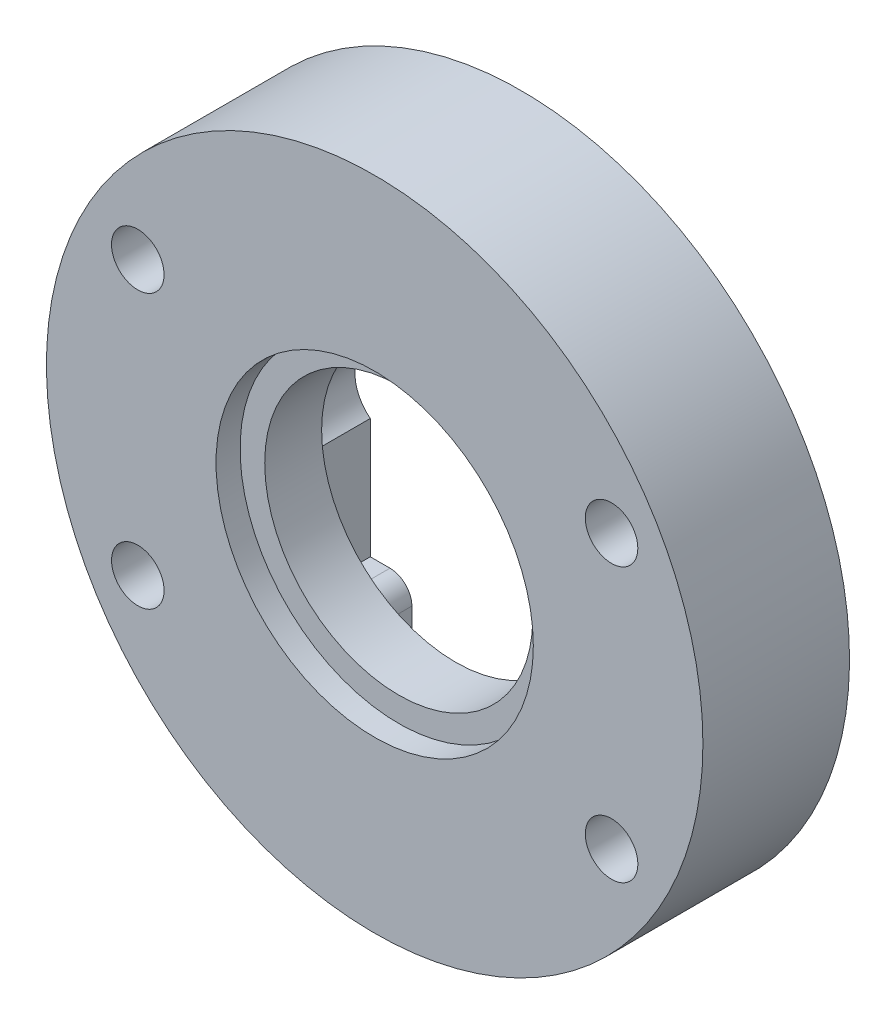
ISO-10303-21;
HEADER;
FILE_DESCRIPTION(('STEP AP214'),'2;1');
FILE_NAME('part.step','',(''),(''),'','','');
FILE_SCHEMA(('AUTOMOTIVE_DESIGN { 1 0 10303 214 1 1 1 1 }'));
ENDSEC;
DATA;
#1=APPLICATION_CONTEXT('core data for automotive mechanical design processes');
#2=APPLICATION_PROTOCOL_DEFINITION('international standard','automotive_design',2000,#1);
#3=PRODUCT_CONTEXT('',#1,'mechanical');
#4=PRODUCT('Part','Part','',(#3));
#5=PRODUCT_RELATED_PRODUCT_CATEGORY('part','',(#4));
#6=PRODUCT_DEFINITION_FORMATION('','',#4);
#7=PRODUCT_DEFINITION_CONTEXT('part definition',#1,'design');
#8=PRODUCT_DEFINITION('design','',#6,#7);
#9=PRODUCT_DEFINITION_SHAPE('','',#8);
#10=(LENGTH_UNIT() NAMED_UNIT(*) SI_UNIT(.MILLI.,.METRE.));
#11=(NAMED_UNIT(*) PLANE_ANGLE_UNIT() SI_UNIT($,.RADIAN.));
#12=(NAMED_UNIT(*) SI_UNIT($,.STERADIAN.) SOLID_ANGLE_UNIT());
#13=UNCERTAINTY_MEASURE_WITH_UNIT(LENGTH_MEASURE(1.E-05),#10,'distance_accuracy_value','');
#14=(GEOMETRIC_REPRESENTATION_CONTEXT(3) GLOBAL_UNCERTAINTY_ASSIGNED_CONTEXT((#13)) GLOBAL_UNIT_ASSIGNED_CONTEXT((#10,
#11,#12)) REPRESENTATION_CONTEXT('',''));
#15=CARTESIAN_POINT('',(0.,0.,0.));
#16=DIRECTION('',(0.,0.,1.));
#17=DIRECTION('',(1.,0.,0.));
#18=AXIS2_PLACEMENT_3D('',#15,#16,#17);
#19=CARTESIAN_POINT('',(0.,0.,5.6));
#20=DIRECTION('',(0.,0.,1.));
#21=DIRECTION('',(1.,0.,0.));
#22=AXIS2_PLACEMENT_3D('',#19,#20,#21);
#23=PLANE('',#22);
#24=CARTESIAN_POINT('',(0.,0.,5.6));
#25=DIRECTION('',(0.,0.,1.));
#26=DIRECTION('',(1.,0.,0.));
#27=AXIS2_PLACEMENT_3D('',#24,#25,#26);
#28=CIRCLE('',#27,6.125);
#29=CARTESIAN_POINT('',(6.125,0.,5.6));
#30=VERTEX_POINT('',#29);
#31=EDGE_CURVE('E337',#30,#30,#28,.T.);
#32=ORIENTED_EDGE('',*,*,#31,.F.);
#33=EDGE_LOOP('',(#32));
#34=FACE_BOUND('',#33,.T.);
#35=CARTESIAN_POINT('',(0.,0.,5.6));
#36=DIRECTION('',(0.,0.,1.));
#37=DIRECTION('',(1.,0.,0.));
#38=AXIS2_PLACEMENT_3D('',#35,#36,#37);
#39=CIRCLE('',#38,7.25);
#40=CARTESIAN_POINT('',(7.25,0.,5.6));
#41=VERTEX_POINT('',#40);
#42=EDGE_CURVE('E220',#41,#41,#39,.F.);
#43=ORIENTED_EDGE('',*,*,#42,.F.);
#44=EDGE_LOOP('',(#43));
#45=FACE_BOUND('',#44,.T.);
#46=ADVANCED_FACE('F35',(#34,#45),#23,.T.);
#47=CARTESIAN_POINT('',(6.90000000000001,-6.9,3.));
#48=DIRECTION('',(1.,0.,0.));
#49=DIRECTION('',(0.,1.,0.));
#50=AXIS2_PLACEMENT_3D('',#47,#48,#49);
#51=PLANE('',#50);
#52=DIRECTION('',(0.,-1.,0.));
#53=VECTOR('',#52,1.);
#54=CARTESIAN_POINT('',(6.90000000000001,-6.9,0.));
#55=LINE('',#54,#53);
#56=CARTESIAN_POINT('',(6.9,6.9,0.));
#57=VERTEX_POINT('',#56);
#58=CARTESIAN_POINT('',(6.9,1.4247806848775,0.));
#59=VERTEX_POINT('',#58);
#60=EDGE_CURVE('E143',#57,#59,#55,.T.);
#61=ORIENTED_EDGE('',*,*,#60,.T.);
#62=DIRECTION('',(0.,0.,1.));
#63=VECTOR('',#62,1.);
#64=CARTESIAN_POINT('',(6.9,1.4247806848775,0.));
#65=LINE('',#64,#63);
#66=CARTESIAN_POINT('',(6.9,1.4247806848775,3.));
#67=VERTEX_POINT('',#66);
#68=EDGE_CURVE('E135',#59,#67,#65,.T.);
#69=ORIENTED_EDGE('',*,*,#68,.T.);
#70=DIRECTION('',(0.,-1.,0.));
#71=VECTOR('',#70,1.);
#72=CARTESIAN_POINT('',(6.90000000000001,-6.9,3.));
#73=LINE('',#72,#71);
#74=CARTESIAN_POINT('',(6.9,6.9,3.));
#75=VERTEX_POINT('',#74);
#76=EDGE_CURVE('E140',#75,#67,#73,.T.);
#77=ORIENTED_EDGE('',*,*,#76,.F.);
#78=DIRECTION('',(0.,0.,-1.));
#79=VECTOR('',#78,1.);
#80=CARTESIAN_POINT('',(6.9,6.9,3.));
#81=LINE('',#80,#79);
#82=EDGE_CURVE('E181',#75,#57,#81,.T.);
#83=ORIENTED_EDGE('',*,*,#82,.T.);
#84=EDGE_LOOP('',(#61,#69,#77,#83));
#85=FACE_BOUND('',#84,.T.);
#86=ADVANCED_FACE('F137',(#85),#51,.F.);
#87=CARTESIAN_POINT('',(-6.9,-6.9,3.));
#88=DIRECTION('',(-1.,0.,0.));
#89=DIRECTION('',(0.,0.,1.));
#90=AXIS2_PLACEMENT_3D('',#87,#88,#89);
#91=PLANE('',#90);
#92=DIRECTION('',(0.,1.,0.));
#93=VECTOR('',#92,1.);
#94=CARTESIAN_POINT('',(-6.9,-6.9,0.));
#95=LINE('',#94,#93);
#96=CARTESIAN_POINT('',(-6.9,-6.9,0.));
#97=VERTEX_POINT('',#96);
#98=CARTESIAN_POINT('',(-6.9,-1.4247806848775,0.));
#99=VERTEX_POINT('',#98);
#100=EDGE_CURVE('E195',#97,#99,#95,.T.);
#101=ORIENTED_EDGE('',*,*,#100,.T.);
#102=DIRECTION('',(0.,0.,1.));
#103=VECTOR('',#102,1.);
#104=CARTESIAN_POINT('',(-6.9,-1.4247806848775,0.));
#105=LINE('',#104,#103);
#106=CARTESIAN_POINT('',(-6.9,-1.4247806848775,3.));
#107=VERTEX_POINT('',#106);
#108=EDGE_CURVE('E330',#99,#107,#105,.T.);
#109=ORIENTED_EDGE('',*,*,#108,.T.);
#110=DIRECTION('',(0.,1.,0.));
#111=VECTOR('',#110,1.);
#112=CARTESIAN_POINT('',(-6.9,-6.9,3.));
#113=LINE('',#112,#111);
#114=CARTESIAN_POINT('',(-6.9,-6.9,3.));
#115=VERTEX_POINT('',#114);
#116=EDGE_CURVE('E177',#115,#107,#113,.T.);
#117=ORIENTED_EDGE('',*,*,#116,.F.);
#118=DIRECTION('',(0.,0.,-1.));
#119=VECTOR('',#118,1.);
#120=CARTESIAN_POINT('',(-6.9,-6.9,3.));
#121=LINE('',#120,#119);
#122=EDGE_CURVE('E203',#115,#97,#121,.T.);
#123=ORIENTED_EDGE('',*,*,#122,.T.);
#124=EDGE_LOOP('',(#101,#109,#117,#123));
#125=FACE_BOUND('',#124,.T.);
#126=ADVANCED_FACE('F277',(#125),#91,.F.);
#127=CARTESIAN_POINT('',(6.90000000000001,-1.42478068487749,3.));
#128=VERTEX_POINT('',#127);
#129=CARTESIAN_POINT('',(6.90000000000001,-6.9,3.));
#130=VERTEX_POINT('',#129);
#131=EDGE_CURVE('E163',#128,#130,#73,.T.);
#132=ORIENTED_EDGE('',*,*,#131,.F.);
#133=DIRECTION('',(0.,0.,1.));
#134=VECTOR('',#133,1.);
#135=CARTESIAN_POINT('',(6.90000000000001,-1.42478068487749,0.));
#136=LINE('',#135,#134);
#137=CARTESIAN_POINT('',(6.90000000000001,-1.42478068487749,0.));
#138=VERTEX_POINT('',#137);
#139=EDGE_CURVE('E147',#128,#138,#136,.F.);
#140=ORIENTED_EDGE('',*,*,#139,.T.);
#141=CARTESIAN_POINT('',(6.90000000000001,-6.9,0.));
#142=VERTEX_POINT('',#141);
#143=EDGE_CURVE('E146',#138,#142,#55,.T.);
#144=ORIENTED_EDGE('',*,*,#143,.T.);
#145=DIRECTION('',(0.,0.,-1.));
#146=VECTOR('',#145,1.);
#147=CARTESIAN_POINT('',(6.90000000000001,-6.9,3.));
#148=LINE('',#147,#146);
#149=EDGE_CURVE('E212',#130,#142,#148,.T.);
#150=ORIENTED_EDGE('',*,*,#149,.F.);
#151=EDGE_LOOP('',(#132,#140,#144,#150));
#152=FACE_BOUND('',#151,.T.);
#153=ADVANCED_FACE('F279',(#152),#51,.F.);
#154=CARTESIAN_POINT('',(6.90000000000001,-6.9,3.));
#155=DIRECTION('',(0.,-1.,0.));
#156=DIRECTION('',(1.,0.,0.));
#157=AXIS2_PLACEMENT_3D('',#154,#155,#156);
#158=PLANE('',#157);
#159=DIRECTION('',(-1.,0.,0.));
#160=VECTOR('',#159,1.);
#161=CARTESIAN_POINT('',(6.90000000000001,-6.9,0.));
#162=LINE('',#161,#160);
#163=CARTESIAN_POINT('',(6.,-6.9,0.));
#164=VERTEX_POINT('',#163);
#165=EDGE_CURVE('E183',#142,#164,#162,.T.);
#166=ORIENTED_EDGE('',*,*,#165,.T.);
#167=DIRECTION('',(0.,0.,-1.));
#168=VECTOR('',#167,1.);
#169=CARTESIAN_POINT('',(6.,-6.9,3.));
#170=LINE('',#169,#168);
#171=CARTESIAN_POINT('',(6.,-6.9,3.));
#172=VERTEX_POINT('',#171);
#173=EDGE_CURVE('E50',#164,#172,#170,.F.);
#174=ORIENTED_EDGE('',*,*,#173,.T.);
#175=DIRECTION('',(-1.,0.,0.));
#176=VECTOR('',#175,1.);
#177=CARTESIAN_POINT('',(6.90000000000001,-6.9,3.));
#178=LINE('',#177,#176);
#179=EDGE_CURVE('E162',#130,#172,#178,.T.);
#180=ORIENTED_EDGE('',*,*,#179,.F.);
#181=ORIENTED_EDGE('',*,*,#149,.T.);
#182=EDGE_LOOP('',(#166,#174,#180,#181));
#183=FACE_BOUND('',#182,.T.);
#184=ADVANCED_FACE('F314',(#183),#158,.F.);
#185=CARTESIAN_POINT('',(5.,-6.9,3.));
#186=DIRECTION('',(1.,0.,0.));
#187=DIRECTION('',(0.,0.,-1.));
#188=AXIS2_PLACEMENT_3D('',#185,#186,#187);
#189=PLANE('',#188);
#190=DIRECTION('',(0.,-1.,0.));
#191=VECTOR('',#190,1.);
#192=CARTESIAN_POINT('',(5.,-6.9,3.));
#193=LINE('',#192,#191);
#194=CARTESIAN_POINT('',(5.,-7.9,3.));
#195=VERTEX_POINT('',#194);
#196=CARTESIAN_POINT('',(5.,-14.1421356237309,3.));
#197=VERTEX_POINT('',#196);
#198=EDGE_CURVE('E165',#195,#197,#193,.T.);
#199=ORIENTED_EDGE('',*,*,#198,.F.);
#200=DIRECTION('',(0.,0.,-1.));
#201=VECTOR('',#200,1.);
#202=CARTESIAN_POINT('',(5.,-7.9,3.));
#203=LINE('',#202,#201);
#204=CARTESIAN_POINT('',(5.,-7.9,0.));
#205=VERTEX_POINT('',#204);
#206=EDGE_CURVE('E232',#195,#205,#203,.T.);
#207=ORIENTED_EDGE('',*,*,#206,.T.);
#208=DIRECTION('',(0.,-1.,0.));
#209=VECTOR('',#208,1.);
#210=CARTESIAN_POINT('',(5.,-6.9,0.));
#211=LINE('',#210,#209);
#212=CARTESIAN_POINT('',(5.,-14.1421356237309,0.));
#213=VERTEX_POINT('',#212);
#214=EDGE_CURVE('E185',#205,#213,#211,.T.);
#215=ORIENTED_EDGE('',*,*,#214,.T.);
#216=DIRECTION('',(0.,0.,-1.));
#217=VECTOR('',#216,1.);
#218=CARTESIAN_POINT('',(5.,-14.1421356237309,3.));
#219=LINE('',#218,#217);
#220=EDGE_CURVE('E209',#197,#213,#219,.T.);
#221=ORIENTED_EDGE('',*,*,#220,.F.);
#222=EDGE_LOOP('',(#199,#207,#215,#221));
#223=FACE_BOUND('',#222,.T.);
#224=ADVANCED_FACE('F263',(#223),#189,.F.);
#225=CARTESIAN_POINT('',(0.,0.,3.));
#226=DIRECTION('',(0.,0.,-1.));
#227=DIRECTION('',(-1.,0.,0.));
#228=AXIS2_PLACEMENT_3D('',#225,#226,#227);
#229=CYLINDRICAL_SURFACE('',#228,15.);
#230=CARTESIAN_POINT('',(0.,0.,0.));
#231=DIRECTION('',(0.,0.,1.));
#232=DIRECTION('',(1.,0.,0.));
#233=AXIS2_PLACEMENT_3D('',#230,#231,#232);
#234=CIRCLE('',#233,15.);
#235=CARTESIAN_POINT('',(-5.00000000000001,-14.1421356237309,0.));
#236=VERTEX_POINT('',#235);
#237=EDGE_CURVE('E187',#213,#236,#234,.T.);
#238=ORIENTED_EDGE('',*,*,#237,.T.);
#239=DIRECTION('',(0.,0.,-1.));
#240=VECTOR('',#239,1.);
#241=CARTESIAN_POINT('',(-5.00000000000001,-14.1421356237309,3.));
#242=LINE('',#241,#240);
#243=CARTESIAN_POINT('',(-5.00000000000001,-14.1421356237309,3.));
#244=VERTEX_POINT('',#243);
#245=EDGE_CURVE('E206',#244,#236,#242,.T.);
#246=ORIENTED_EDGE('',*,*,#245,.F.);
#247=CARTESIAN_POINT('',(0.,0.,3.));
#248=DIRECTION('',(0.,0.,1.));
#249=DIRECTION('',(1.,0.,0.));
#250=AXIS2_PLACEMENT_3D('',#247,#248,#249);
#251=CIRCLE('',#250,15.);
#252=EDGE_CURVE('E156',#244,#197,#251,.T.);
#253=ORIENTED_EDGE('',*,*,#252,.T.);
#254=ORIENTED_EDGE('',*,*,#220,.T.);
#255=EDGE_LOOP('',(#238,#246,#253,#254));
#256=FACE_BOUND('',#255,.T.);
#257=CARTESIAN_POINT('',(0.,0.,6.7));
#258=DIRECTION('',(0.,0.,1.));
#259=DIRECTION('',(1.,0.,0.));
#260=AXIS2_PLACEMENT_3D('',#257,#258,#259);
#261=CIRCLE('',#260,15.);
#262=CARTESIAN_POINT('',(15.,0.,6.7));
#263=VERTEX_POINT('',#262);
#264=EDGE_CURVE('E341',#263,#263,#261,.T.);
#265=ORIENTED_EDGE('',*,*,#264,.F.);
#266=EDGE_LOOP('',(#265));
#267=FACE_BOUND('',#266,.T.);
#268=ADVANCED_FACE('F257',(#256,#267),#229,.T.);
#269=CARTESIAN_POINT('',(-5.,-6.9,3.));
#270=DIRECTION('',(-1.,0.,0.));
#271=DIRECTION('',(0.,-1.,0.));
#272=AXIS2_PLACEMENT_3D('',#269,#270,#271);
#273=PLANE('',#272);
#274=DIRECTION('',(0.,1.,0.));
#275=VECTOR('',#274,1.);
#276=CARTESIAN_POINT('',(-5.,-6.9,0.));
#277=LINE('',#276,#275);
#278=CARTESIAN_POINT('',(-5.,-7.9,0.));
#279=VERTEX_POINT('',#278);
#280=EDGE_CURVE('E189',#236,#279,#277,.T.);
#281=ORIENTED_EDGE('',*,*,#280,.T.);
#282=DIRECTION('',(0.,0.,-1.));
#283=VECTOR('',#282,1.);
#284=CARTESIAN_POINT('',(-5.,-7.9,3.));
#285=LINE('',#284,#283);
#286=CARTESIAN_POINT('',(-5.,-7.9,3.));
#287=VERTEX_POINT('',#286);
#288=EDGE_CURVE('E230',#279,#287,#285,.F.);
#289=ORIENTED_EDGE('',*,*,#288,.T.);
#290=DIRECTION('',(0.,1.,0.));
#291=VECTOR('',#290,1.);
#292=CARTESIAN_POINT('',(-5.,-6.9,3.));
#293=LINE('',#292,#291);
#294=EDGE_CURVE('E171',#244,#287,#293,.T.);
#295=ORIENTED_EDGE('',*,*,#294,.F.);
#296=ORIENTED_EDGE('',*,*,#245,.T.);
#297=EDGE_LOOP('',(#281,#289,#295,#296));
#298=FACE_BOUND('',#297,.T.);
#299=ADVANCED_FACE('F254',(#298),#273,.F.);
#300=CARTESIAN_POINT('',(-5.,-6.9,3.));
#301=DIRECTION('',(0.,-1.,0.));
#302=DIRECTION('',(0.,0.,-1.));
#303=AXIS2_PLACEMENT_3D('',#300,#301,#302);
#304=PLANE('',#303);
#305=DIRECTION('',(-1.,0.,0.));
#306=VECTOR('',#305,1.);
#307=CARTESIAN_POINT('',(-5.,-6.9,3.));
#308=LINE('',#307,#306);
#309=CARTESIAN_POINT('',(-6.,-6.9,3.));
#310=VERTEX_POINT('',#309);
#311=EDGE_CURVE('E174',#310,#115,#308,.T.);
#312=ORIENTED_EDGE('',*,*,#311,.F.);
#313=DIRECTION('',(0.,0.,-1.));
#314=VECTOR('',#313,1.);
#315=CARTESIAN_POINT('',(-6.,-6.9,3.));
#316=LINE('',#315,#314);
#317=CARTESIAN_POINT('',(-6.,-6.9,0.));
#318=VERTEX_POINT('',#317);
#319=EDGE_CURVE('E223',#310,#318,#316,.T.);
#320=ORIENTED_EDGE('',*,*,#319,.T.);
#321=DIRECTION('',(-1.,0.,0.));
#322=VECTOR('',#321,1.);
#323=CARTESIAN_POINT('',(-5.,-6.9,0.));
#324=LINE('',#323,#322);
#325=EDGE_CURVE('E192',#318,#97,#324,.T.);
#326=ORIENTED_EDGE('',*,*,#325,.T.);
#327=ORIENTED_EDGE('',*,*,#122,.F.);
#328=EDGE_LOOP('',(#312,#320,#326,#327));
#329=FACE_BOUND('',#328,.T.);
#330=ADVANCED_FACE('F244',(#329),#304,.F.);
#331=CARTESIAN_POINT('',(-6.9,1.4247806848775,3.));
#332=VERTEX_POINT('',#331);
#333=CARTESIAN_POINT('',(-6.9,6.9,3.));
#334=VERTEX_POINT('',#333);
#335=EDGE_CURVE('E176',#332,#334,#113,.T.);
#336=ORIENTED_EDGE('',*,*,#335,.F.);
#337=DIRECTION('',(0.,0.,1.));
#338=VECTOR('',#337,1.);
#339=CARTESIAN_POINT('',(-6.9,1.4247806848775,0.));
#340=LINE('',#339,#338);
#341=CARTESIAN_POINT('',(-6.9,1.4247806848775,0.));
#342=VERTEX_POINT('',#341);
#343=EDGE_CURVE('E329',#332,#342,#340,.F.);
#344=ORIENTED_EDGE('',*,*,#343,.T.);
#345=CARTESIAN_POINT('',(-6.9,6.9,0.));
#346=VERTEX_POINT('',#345);
#347=EDGE_CURVE('E194',#342,#346,#95,.T.);
#348=ORIENTED_EDGE('',*,*,#347,.T.);
#349=DIRECTION('',(0.,0.,-1.));
#350=VECTOR('',#349,1.);
#351=CARTESIAN_POINT('',(-6.9,6.9,3.));
#352=LINE('',#351,#350);
#353=EDGE_CURVE('E200',#334,#346,#352,.T.);
#354=ORIENTED_EDGE('',*,*,#353,.F.);
#355=EDGE_LOOP('',(#336,#344,#348,#354));
#356=FACE_BOUND('',#355,.T.);
#357=ADVANCED_FACE('F301',(#356),#91,.F.);
#358=CARTESIAN_POINT('',(6.9,6.9,3.));
#359=DIRECTION('',(0.,1.,0.));
#360=DIRECTION('',(-1.,0.,0.));
#361=AXIS2_PLACEMENT_3D('',#358,#359,#360);
#362=PLANE('',#361);
#363=DIRECTION('',(1.,0.,0.));
#364=VECTOR('',#363,1.);
#365=CARTESIAN_POINT('',(6.9,6.9,0.));
#366=LINE('',#365,#364);
#367=EDGE_CURVE('E167',#346,#57,#366,.T.);
#368=ORIENTED_EDGE('',*,*,#367,.T.);
#369=ORIENTED_EDGE('',*,*,#82,.F.);
#370=DIRECTION('',(1.,0.,0.));
#371=VECTOR('',#370,1.);
#372=CARTESIAN_POINT('',(6.9,6.9,3.));
#373=LINE('',#372,#371);
#374=EDGE_CURVE('E161',#334,#75,#373,.T.);
#375=ORIENTED_EDGE('',*,*,#374,.F.);
#376=ORIENTED_EDGE('',*,*,#353,.T.);
#377=EDGE_LOOP('',(#368,#369,#375,#376));
#378=FACE_BOUND('',#377,.T.);
#379=ADVANCED_FACE('F297',(#378),#362,.F.);
#380=CARTESIAN_POINT('',(0.,0.,0.));
#381=DIRECTION('',(0.,0.,1.));
#382=DIRECTION('',(1.,0.,0.));
#383=AXIS2_PLACEMENT_3D('',#380,#381,#382);
#384=PLANE('',#383);
#385=CARTESIAN_POINT('',(-10.8253175473055,6.24999999999998,0.));
#386=DIRECTION('',(0.,0.,1.));
#387=DIRECTION('',(-1.,0.,0.));
#388=AXIS2_PLACEMENT_3D('',#385,#386,#387);
#389=CIRCLE('',#388,1.2);
#390=CARTESIAN_POINT('',(-12.0253175473055,6.24999999999998,0.));
#391=VERTEX_POINT('',#390);
#392=EDGE_CURVE('E353',#391,#391,#389,.T.);
#393=ORIENTED_EDGE('',*,*,#392,.T.);
#394=EDGE_LOOP('',(#393));
#395=FACE_BOUND('',#394,.T.);
#396=CARTESIAN_POINT('',(10.8253175473055,-6.24999999999998,0.));
#397=DIRECTION('',(0.,0.,1.));
#398=DIRECTION('',(-1.,0.,0.));
#399=AXIS2_PLACEMENT_3D('',#396,#397,#398);
#400=CIRCLE('',#399,1.2);
#401=CARTESIAN_POINT('',(9.62531754730549,-6.24999999999998,0.));
#402=VERTEX_POINT('',#401);
#403=EDGE_CURVE('E365',#402,#402,#400,.T.);
#404=ORIENTED_EDGE('',*,*,#403,.T.);
#405=EDGE_LOOP('',(#404));
#406=FACE_BOUND('',#405,.T.);
#407=CARTESIAN_POINT('',(-10.8253175473055,-6.24999999999998,0.));
#408=DIRECTION('',(0.,0.,1.));
#409=DIRECTION('',(1.,0.,0.));
#410=AXIS2_PLACEMENT_3D('',#407,#408,#409);
#411=CIRCLE('',#410,1.2);
#412=CARTESIAN_POINT('',(-9.6253175473055,-6.24999999999998,0.));
#413=VERTEX_POINT('',#412);
#414=EDGE_CURVE('E359',#413,#413,#411,.T.);
#415=ORIENTED_EDGE('',*,*,#414,.T.);
#416=EDGE_LOOP('',(#415));
#417=FACE_BOUND('',#416,.T.);
#418=CARTESIAN_POINT('',(10.8253175473055,6.24999999999998,0.));
#419=DIRECTION('',(0.,0.,1.));
#420=DIRECTION('',(1.,0.,0.));
#421=AXIS2_PLACEMENT_3D('',#418,#419,#420);
#422=CIRCLE('',#421,1.2);
#423=CARTESIAN_POINT('',(12.0253175473055,6.24999999999998,0.));
#424=VERTEX_POINT('',#423);
#425=EDGE_CURVE('E349',#424,#424,#422,.T.);
#426=ORIENTED_EDGE('',*,*,#425,.T.);
#427=EDGE_LOOP('',(#426));
#428=FACE_BOUND('',#427,.T.);
#429=ORIENTED_EDGE('',*,*,#325,.F.);
#430=CARTESIAN_POINT('',(-6.,-7.9,0.));
#431=DIRECTION('',(0.,0.,1.));
#432=DIRECTION('',(1.,0.,0.));
#433=AXIS2_PLACEMENT_3D('',#430,#431,#432);
#434=CIRCLE('',#433,1.);
#435=EDGE_CURVE('E228',#318,#279,#434,.F.);
#436=ORIENTED_EDGE('',*,*,#435,.T.);
#437=ORIENTED_EDGE('',*,*,#280,.F.);
#438=ORIENTED_EDGE('',*,*,#237,.F.);
#439=ORIENTED_EDGE('',*,*,#214,.F.);
#440=CARTESIAN_POINT('',(6.,-7.9,0.));
#441=DIRECTION('',(0.,0.,1.));
#442=DIRECTION('',(1.,0.,0.));
#443=AXIS2_PLACEMENT_3D('',#440,#441,#442);
#444=CIRCLE('',#443,1.);
#445=EDGE_CURVE('E226',#205,#164,#444,.F.);
#446=ORIENTED_EDGE('',*,*,#445,.T.);
#447=ORIENTED_EDGE('',*,*,#165,.F.);
#448=ORIENTED_EDGE('',*,*,#143,.F.);
#449=CARTESIAN_POINT('',(5.8,0.,0.));
#450=DIRECTION('',(0.,0.,1.));
#451=DIRECTION('',(1.,0.,0.));
#452=AXIS2_PLACEMENT_3D('',#449,#450,#451);
#453=CIRCLE('',#452,1.8);
#454=EDGE_CURVE('E218',#138,#59,#453,.T.);
#455=ORIENTED_EDGE('',*,*,#454,.T.);
#456=ORIENTED_EDGE('',*,*,#60,.F.);
#457=ORIENTED_EDGE('',*,*,#367,.F.);
#458=ORIENTED_EDGE('',*,*,#347,.F.);
#459=CARTESIAN_POINT('',(-5.8,0.,0.));
#460=DIRECTION('',(0.,0.,1.));
#461=DIRECTION('',(1.,0.,0.));
#462=AXIS2_PLACEMENT_3D('',#459,#460,#461);
#463=CIRCLE('',#462,1.8);
#464=EDGE_CURVE('E215',#342,#99,#463,.T.);
#465=ORIENTED_EDGE('',*,*,#464,.T.);
#466=ORIENTED_EDGE('',*,*,#100,.F.);
#467=EDGE_LOOP('',(#429,#436,#437,#438,#439,#446,#447,#448,#455,#456,#457,#458,#465,#466));
#468=FACE_BOUND('',#467,.T.);
#469=ADVANCED_FACE('F250',(#395,#406,#417,#428,#468),#384,.F.);
#470=CARTESIAN_POINT('',(-5.8,0.,0.));
#471=DIRECTION('',(0.,0.,1.));
#472=DIRECTION('',(1.,0.,0.));
#473=AXIS2_PLACEMENT_3D('',#470,#471,#472);
#474=CYLINDRICAL_SURFACE('',#473,1.8);
#475=ORIENTED_EDGE('',*,*,#464,.F.);
#476=ORIENTED_EDGE('',*,*,#343,.F.);
#477=CARTESIAN_POINT('',(-5.8,0.,3.));
#478=DIRECTION('',(0.,0.,1.));
#479=DIRECTION('',(1.,0.,0.));
#480=AXIS2_PLACEMENT_3D('',#477,#478,#479);
#481=CIRCLE('',#480,1.8);
#482=EDGE_CURVE('E155',#332,#107,#481,.T.);
#483=ORIENTED_EDGE('',*,*,#482,.T.);
#484=ORIENTED_EDGE('',*,*,#108,.F.);
#485=EDGE_LOOP('',(#475,#476,#483,#484));
#486=FACE_BOUND('',#485,.T.);
#487=ADVANCED_FACE('F289',(#486),#474,.F.);
#488=CARTESIAN_POINT('',(5.8,0.,0.));
#489=DIRECTION('',(0.,0.,1.));
#490=DIRECTION('',(1.,0.,0.));
#491=AXIS2_PLACEMENT_3D('',#488,#489,#490);
#492=CYLINDRICAL_SURFACE('',#491,1.8);
#493=ORIENTED_EDGE('',*,*,#454,.F.);
#494=ORIENTED_EDGE('',*,*,#139,.F.);
#495=CARTESIAN_POINT('',(5.8,0.,3.));
#496=DIRECTION('',(0.,0.,1.));
#497=DIRECTION('',(1.,0.,0.));
#498=AXIS2_PLACEMENT_3D('',#495,#496,#497);
#499=CIRCLE('',#498,1.8);
#500=EDGE_CURVE('E150',#128,#67,#499,.T.);
#501=ORIENTED_EDGE('',*,*,#500,.T.);
#502=ORIENTED_EDGE('',*,*,#68,.F.);
#503=EDGE_LOOP('',(#493,#494,#501,#502));
#504=FACE_BOUND('',#503,.T.);
#505=ADVANCED_FACE('F151',(#504),#492,.F.);
#506=CARTESIAN_POINT('',(0.,0.,3.));
#507=DIRECTION('',(0.,0.,1.));
#508=DIRECTION('',(1.,0.,0.));
#509=AXIS2_PLACEMENT_3D('',#506,#507,#508);
#510=PLANE('',#509);
#511=CARTESIAN_POINT('',(0.,0.,3.));
#512=DIRECTION('',(0.,0.,1.));
#513=DIRECTION('',(1.,0.,0.));
#514=AXIS2_PLACEMENT_3D('',#511,#512,#513);
#515=CIRCLE('',#514,6.125);
#516=CARTESIAN_POINT('',(6.125,0.,3.));
#517=VERTEX_POINT('',#516);
#518=EDGE_CURVE('E338',#517,#517,#515,.T.);
#519=ORIENTED_EDGE('',*,*,#518,.T.);
#520=EDGE_LOOP('',(#519));
#521=FACE_BOUND('',#520,.T.);
#522=ORIENTED_EDGE('',*,*,#179,.T.);
#523=CARTESIAN_POINT('',(6.,-7.9,3.));
#524=DIRECTION('',(0.,0.,1.));
#525=DIRECTION('',(1.,0.,0.));
#526=AXIS2_PLACEMENT_3D('',#523,#524,#525);
#527=CIRCLE('',#526,1.);
#528=EDGE_CURVE('E11',#172,#195,#527,.T.);
#529=ORIENTED_EDGE('',*,*,#528,.T.);
#530=ORIENTED_EDGE('',*,*,#198,.T.);
#531=ORIENTED_EDGE('',*,*,#252,.F.);
#532=ORIENTED_EDGE('',*,*,#294,.T.);
#533=CARTESIAN_POINT('',(-6.,-7.9,3.));
#534=DIRECTION('',(0.,0.,1.));
#535=DIRECTION('',(1.,0.,0.));
#536=AXIS2_PLACEMENT_3D('',#533,#534,#535);
#537=CIRCLE('',#536,1.);
#538=EDGE_CURVE('E43',#287,#310,#537,.T.);
#539=ORIENTED_EDGE('',*,*,#538,.T.);
#540=ORIENTED_EDGE('',*,*,#311,.T.);
#541=ORIENTED_EDGE('',*,*,#116,.T.);
#542=ORIENTED_EDGE('',*,*,#482,.F.);
#543=ORIENTED_EDGE('',*,*,#335,.T.);
#544=ORIENTED_EDGE('',*,*,#374,.T.);
#545=ORIENTED_EDGE('',*,*,#76,.T.);
#546=ORIENTED_EDGE('',*,*,#500,.F.);
#547=ORIENTED_EDGE('',*,*,#131,.T.);
#548=EDGE_LOOP('',(#522,#529,#530,#531,#532,#539,#540,#541,#542,#543,#544,#545,#546,#547));
#549=FACE_BOUND('',#548,.T.);
#550=ADVANCED_FACE('F158',(#521,#549),#510,.F.);
#551=CARTESIAN_POINT('',(0.,0.,5.6));
#552=DIRECTION('',(0.,0.,-1.));
#553=DIRECTION('',(-1.,0.,0.));
#554=AXIS2_PLACEMENT_3D('',#551,#552,#553);
#555=CYLINDRICAL_SURFACE('',#554,6.125);
#556=ORIENTED_EDGE('',*,*,#31,.T.);
#557=EDGE_LOOP('',(#556));
#558=FACE_BOUND('',#557,.T.);
#559=ORIENTED_EDGE('',*,*,#518,.F.);
#560=EDGE_LOOP('',(#559));
#561=FACE_BOUND('',#560,.T.);
#562=ADVANCED_FACE('F284',(#558,#561),#555,.F.);
#563=CARTESIAN_POINT('',(0.,0.,6.7));
#564=DIRECTION('',(0.,0.,1.));
#565=DIRECTION('',(1.,0.,0.));
#566=AXIS2_PLACEMENT_3D('',#563,#564,#565);
#567=PLANE('',#566);
#568=CARTESIAN_POINT('',(-10.8253175473055,6.24999999999998,6.7));
#569=DIRECTION('',(0.,0.,1.));
#570=DIRECTION('',(-1.,0.,0.));
#571=AXIS2_PLACEMENT_3D('',#568,#569,#570);
#572=CIRCLE('',#571,1.2);
#573=CARTESIAN_POINT('',(-12.0253175473055,6.24999999999998,6.7));
#574=VERTEX_POINT('',#573);
#575=EDGE_CURVE('E368',#574,#574,#572,.T.);
#576=ORIENTED_EDGE('',*,*,#575,.F.);
#577=EDGE_LOOP('',(#576));
#578=FACE_BOUND('',#577,.T.);
#579=CARTESIAN_POINT('',(10.8253175473055,-6.24999999999998,6.7));
#580=DIRECTION('',(0.,0.,1.));
#581=DIRECTION('',(-1.,0.,0.));
#582=AXIS2_PLACEMENT_3D('',#579,#580,#581);
#583=CIRCLE('',#582,1.2);
#584=CARTESIAN_POINT('',(9.62531754730549,-6.24999999999998,6.7));
#585=VERTEX_POINT('',#584);
#586=EDGE_CURVE('E362',#585,#585,#583,.T.);
#587=ORIENTED_EDGE('',*,*,#586,.F.);
#588=EDGE_LOOP('',(#587));
#589=FACE_BOUND('',#588,.T.);
#590=CARTESIAN_POINT('',(-10.8253175473055,-6.24999999999998,6.7));
#591=DIRECTION('',(0.,0.,1.));
#592=DIRECTION('',(1.,0.,0.));
#593=AXIS2_PLACEMENT_3D('',#590,#591,#592);
#594=CIRCLE('',#593,1.2);
#595=CARTESIAN_POINT('',(-9.6253175473055,-6.24999999999998,6.7));
#596=VERTEX_POINT('',#595);
#597=EDGE_CURVE('E356',#596,#596,#594,.T.);
#598=ORIENTED_EDGE('',*,*,#597,.F.);
#599=EDGE_LOOP('',(#598));
#600=FACE_BOUND('',#599,.T.);
#601=CARTESIAN_POINT('',(10.8253175473055,6.24999999999998,6.7));
#602=DIRECTION('',(0.,0.,1.));
#603=DIRECTION('',(1.,0.,0.));
#604=AXIS2_PLACEMENT_3D('',#601,#602,#603);
#605=CIRCLE('',#604,1.2);
#606=CARTESIAN_POINT('',(12.0253175473055,6.24999999999998,6.7));
#607=VERTEX_POINT('',#606);
#608=EDGE_CURVE('E350',#607,#607,#605,.T.);
#609=ORIENTED_EDGE('',*,*,#608,.F.);
#610=EDGE_LOOP('',(#609));
#611=FACE_BOUND('',#610,.T.);
#612=ORIENTED_EDGE('',*,*,#264,.T.);
#613=EDGE_LOOP('',(#612));
#614=FACE_BOUND('',#613,.T.);
#615=CARTESIAN_POINT('',(0.,0.,6.7));
#616=DIRECTION('',(0.,0.,1.));
#617=DIRECTION('',(1.,0.,0.));
#618=AXIS2_PLACEMENT_3D('',#615,#616,#617);
#619=CIRCLE('',#618,7.25);
#620=CARTESIAN_POINT('',(7.25,0.,6.7));
#621=VERTEX_POINT('',#620);
#622=EDGE_CURVE('E346',#621,#621,#619,.T.);
#623=ORIENTED_EDGE('',*,*,#622,.F.);
#624=EDGE_LOOP('',(#623));
#625=FACE_BOUND('',#624,.T.);
#626=ADVANCED_FACE('F381',(#578,#589,#600,#611,#614,#625),#567,.T.);
#627=CARTESIAN_POINT('',(0.,0.,6.7));
#628=DIRECTION('',(0.,0.,-1.));
#629=DIRECTION('',(-1.,0.,0.));
#630=AXIS2_PLACEMENT_3D('',#627,#628,#629);
#631=CYLINDRICAL_SURFACE('',#630,7.25);
#632=ORIENTED_EDGE('',*,*,#622,.T.);
#633=EDGE_LOOP('',(#632));
#634=FACE_BOUND('',#633,.T.);
#635=ORIENTED_EDGE('',*,*,#42,.T.);
#636=EDGE_LOOP('',(#635));
#637=FACE_BOUND('',#636,.T.);
#638=ADVANCED_FACE('F384',(#634,#637),#631,.F.);
#639=CARTESIAN_POINT('',(10.8253175473055,6.24999999999998,0.));
#640=DIRECTION('',(0.,0.,1.));
#641=DIRECTION('',(1.,0.,0.));
#642=AXIS2_PLACEMENT_3D('',#639,#640,#641);
#643=CYLINDRICAL_SURFACE('',#642,1.2);
#644=ORIENTED_EDGE('',*,*,#425,.F.);
#645=EDGE_LOOP('',(#644));
#646=FACE_BOUND('',#645,.T.);
#647=ORIENTED_EDGE('',*,*,#608,.T.);
#648=EDGE_LOOP('',(#647));
#649=FACE_BOUND('',#648,.T.);
#650=ADVANCED_FACE('F397',(#646,#649),#643,.F.);
#651=CARTESIAN_POINT('',(-10.8253175473055,-6.24999999999998,0.));
#652=DIRECTION('',(0.,0.,1.));
#653=DIRECTION('',(1.,0.,0.));
#654=AXIS2_PLACEMENT_3D('',#651,#652,#653);
#655=CYLINDRICAL_SURFACE('',#654,1.2);
#656=ORIENTED_EDGE('',*,*,#414,.F.);
#657=EDGE_LOOP('',(#656));
#658=FACE_BOUND('',#657,.T.);
#659=ORIENTED_EDGE('',*,*,#597,.T.);
#660=EDGE_LOOP('',(#659));
#661=FACE_BOUND('',#660,.T.);
#662=ADVANCED_FACE('F403',(#658,#661),#655,.F.);
#663=CARTESIAN_POINT('',(10.8253175473055,-6.24999999999998,0.));
#664=DIRECTION('',(0.,0.,1.));
#665=DIRECTION('',(1.,0.,0.));
#666=AXIS2_PLACEMENT_3D('',#663,#664,#665);
#667=CYLINDRICAL_SURFACE('',#666,1.2);
#668=ORIENTED_EDGE('',*,*,#403,.F.);
#669=EDGE_LOOP('',(#668));
#670=FACE_BOUND('',#669,.T.);
#671=ORIENTED_EDGE('',*,*,#586,.T.);
#672=EDGE_LOOP('',(#671));
#673=FACE_BOUND('',#672,.T.);
#674=ADVANCED_FACE('F377',(#670,#673),#667,.F.);
#675=CARTESIAN_POINT('',(-10.8253175473055,6.24999999999998,0.));
#676=DIRECTION('',(0.,0.,1.));
#677=DIRECTION('',(1.,0.,0.));
#678=AXIS2_PLACEMENT_3D('',#675,#676,#677);
#679=CYLINDRICAL_SURFACE('',#678,1.2);
#680=ORIENTED_EDGE('',*,*,#392,.F.);
#681=EDGE_LOOP('',(#680));
#682=FACE_BOUND('',#681,.T.);
#683=ORIENTED_EDGE('',*,*,#575,.T.);
#684=EDGE_LOOP('',(#683));
#685=FACE_BOUND('',#684,.T.);
#686=ADVANCED_FACE('F270',(#682,#685),#679,.F.);
#687=CARTESIAN_POINT('',(-6.,-7.9,3.));
#688=DIRECTION('',(0.,0.,-1.));
#689=DIRECTION('',(-1.,0.,0.));
#690=AXIS2_PLACEMENT_3D('',#687,#688,#689);
#691=CYLINDRICAL_SURFACE('',#690,1.);
#692=ORIENTED_EDGE('',*,*,#538,.F.);
#693=ORIENTED_EDGE('',*,*,#288,.F.);
#694=ORIENTED_EDGE('',*,*,#435,.F.);
#695=ORIENTED_EDGE('',*,*,#319,.F.);
#696=EDGE_LOOP('',(#692,#693,#694,#695));
#697=FACE_BOUND('',#696,.T.);
#698=ADVANCED_FACE('F247',(#697),#691,.T.);
#699=CARTESIAN_POINT('',(6.,-7.9,3.));
#700=DIRECTION('',(0.,0.,-1.));
#701=DIRECTION('',(-1.,0.,0.));
#702=AXIS2_PLACEMENT_3D('',#699,#700,#701);
#703=CYLINDRICAL_SURFACE('',#702,1.);
#704=ORIENTED_EDGE('',*,*,#528,.F.);
#705=ORIENTED_EDGE('',*,*,#173,.F.);
#706=ORIENTED_EDGE('',*,*,#445,.F.);
#707=ORIENTED_EDGE('',*,*,#206,.F.);
#708=EDGE_LOOP('',(#704,#705,#706,#707));
#709=FACE_BOUND('',#708,.T.);
#710=ADVANCED_FACE('F37',(#709),#703,.T.);
#711=CLOSED_SHELL('',(#46,#86,#126,#153,#184,#224,#268,#299,#330,#357,#379,#469,#487,#505,#550,
#562,#626,#638,#650,#662,#674,#686,#698,#710));
#712=MANIFOLD_SOLID_BREP('B2',#711);
#713=ADVANCED_BREP_SHAPE_REPRESENTATION('',(#18,#712),#14);
#714=SHAPE_DEFINITION_REPRESENTATION(#9,#713);
ENDSEC;
END-ISO-10303-21;
